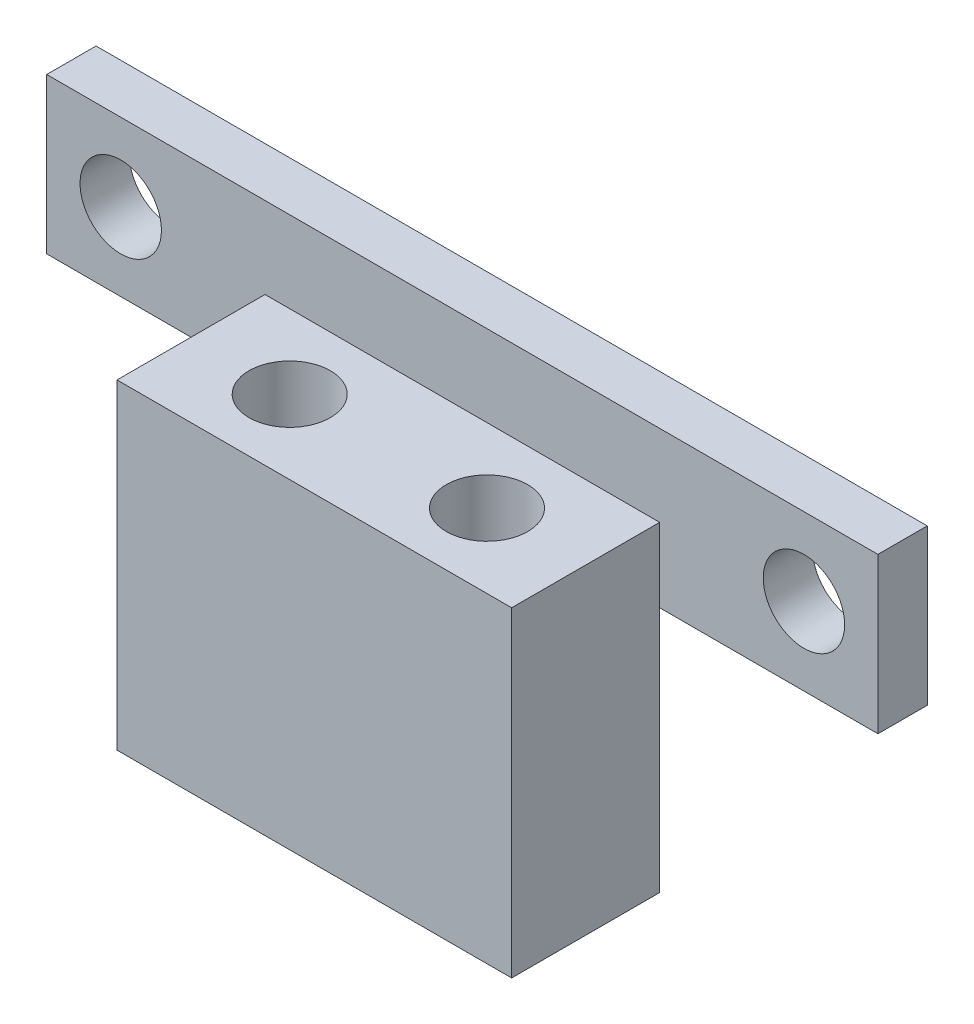
ISO-10303-21;
HEADER;
FILE_DESCRIPTION(('STEP AP214'),'2;1');
FILE_NAME('part.step','',(''),(''),'','','');
FILE_SCHEMA(('AUTOMOTIVE_DESIGN { 1 0 10303 214 1 1 1 1 }'));
ENDSEC;
DATA;
#1=APPLICATION_CONTEXT('core data for automotive mechanical design processes');
#2=APPLICATION_PROTOCOL_DEFINITION('international standard','automotive_design',2000,#1);
#3=PRODUCT_CONTEXT('',#1,'mechanical');
#4=PRODUCT('Part','Part','',(#3));
#5=PRODUCT_RELATED_PRODUCT_CATEGORY('part','',(#4));
#6=PRODUCT_DEFINITION_FORMATION('','',#4);
#7=PRODUCT_DEFINITION_CONTEXT('part definition',#1,'design');
#8=PRODUCT_DEFINITION('design','',#6,#7);
#9=PRODUCT_DEFINITION_SHAPE('','',#8);
#10=(LENGTH_UNIT() NAMED_UNIT(*) SI_UNIT(.MILLI.,.METRE.));
#11=(NAMED_UNIT(*) PLANE_ANGLE_UNIT() SI_UNIT($,.RADIAN.));
#12=(NAMED_UNIT(*) SI_UNIT($,.STERADIAN.) SOLID_ANGLE_UNIT());
#13=UNCERTAINTY_MEASURE_WITH_UNIT(LENGTH_MEASURE(1.E-05),#10,'distance_accuracy_value','');
#14=(GEOMETRIC_REPRESENTATION_CONTEXT(3) GLOBAL_UNCERTAINTY_ASSIGNED_CONTEXT((#13)) GLOBAL_UNIT_ASSIGNED_CONTEXT((#10,
#11,#12)) REPRESENTATION_CONTEXT('',''));
#15=CARTESIAN_POINT('',(0.,0.,0.));
#16=DIRECTION('',(0.,0.,1.));
#17=DIRECTION('',(1.,0.,0.));
#18=AXIS2_PLACEMENT_3D('',#15,#16,#17);
#19=CARTESIAN_POINT('',(0.,0.,2.));
#20=DIRECTION('',(0.,1.,0.));
#21=DIRECTION('',(0.,0.,1.));
#22=AXIS2_PLACEMENT_3D('',#19,#20,#21);
#23=PLANE('',#22);
#24=DIRECTION('',(1.,0.,0.));
#25=VECTOR('',#24,1.);
#26=CARTESIAN_POINT('',(8.85,0.,2.));
#27=LINE('',#26,#25);
#28=CARTESIAN_POINT('',(8.85,0.,2.));
#29=VERTEX_POINT('',#28);
#30=CARTESIAN_POINT('',(24.85,0.,2.));
#31=VERTEX_POINT('',#30);
#32=EDGE_CURVE('E64',#29,#31,#27,.T.);
#33=ORIENTED_EDGE('',*,*,#32,.F.);
#34=DIRECTION('',(1.,0.,0.));
#35=VECTOR('',#34,1.);
#36=CARTESIAN_POINT('',(0.,0.,2.));
#37=LINE('',#36,#35);
#38=CARTESIAN_POINT('',(0.,0.,2.));
#39=VERTEX_POINT('',#38);
#40=EDGE_CURVE('E181',#39,#29,#37,.T.);
#41=ORIENTED_EDGE('',*,*,#40,.F.);
#42=DIRECTION('',(0.,0.,-1.));
#43=VECTOR('',#42,1.);
#44=CARTESIAN_POINT('',(0.,0.,2.));
#45=LINE('',#44,#43);
#46=CARTESIAN_POINT('',(0.,0.,0.));
#47=VERTEX_POINT('',#46);
#48=EDGE_CURVE('E11',#39,#47,#45,.T.);
#49=ORIENTED_EDGE('',*,*,#48,.T.);
#50=DIRECTION('',(1.,0.,0.));
#51=VECTOR('',#50,1.);
#52=CARTESIAN_POINT('',(0.,0.,0.));
#53=LINE('',#52,#51);
#54=CARTESIAN_POINT('',(33.7,0.,0.));
#55=VERTEX_POINT('',#54);
#56=EDGE_CURVE('E190',#47,#55,#53,.T.);
#57=ORIENTED_EDGE('',*,*,#56,.T.);
#58=DIRECTION('',(0.,0.,-1.));
#59=VECTOR('',#58,1.);
#60=CARTESIAN_POINT('',(33.7,0.,2.));
#61=LINE('',#60,#59);
#62=CARTESIAN_POINT('',(33.7,0.,2.));
#63=VERTEX_POINT('',#62);
#64=EDGE_CURVE('E49',#63,#55,#61,.T.);
#65=ORIENTED_EDGE('',*,*,#64,.F.);
#66=EDGE_CURVE('E179',#31,#63,#37,.T.);
#67=ORIENTED_EDGE('',*,*,#66,.F.);
#68=EDGE_LOOP('',(#33,#41,#49,#57,#65,#67));
#69=FACE_BOUND('',#68,.T.);
#70=ADVANCED_FACE('F41',(#69),#23,.F.);
#71=CARTESIAN_POINT('',(0.,0.,2.));
#72=DIRECTION('',(0.,0.,-1.));
#73=DIRECTION('',(-1.,0.,0.));
#74=AXIS2_PLACEMENT_3D('',#71,#72,#73);
#75=PLANE('',#74);
#76=CARTESIAN_POINT('',(30.7,3.15,2.));
#77=DIRECTION('',(0.,0.,1.));
#78=DIRECTION('',(1.,0.,0.));
#79=AXIS2_PLACEMENT_3D('',#76,#77,#78);
#80=CIRCLE('',#79,1.65);
#81=CARTESIAN_POINT('',(32.35,3.15,2.));
#82=VERTEX_POINT('',#81);
#83=EDGE_CURVE('E164',#82,#82,#80,.T.);
#84=ORIENTED_EDGE('',*,*,#83,.F.);
#85=EDGE_LOOP('',(#84));
#86=FACE_BOUND('',#85,.T.);
#87=CARTESIAN_POINT('',(3.,3.15,2.));
#88=DIRECTION('',(0.,0.,1.));
#89=DIRECTION('',(1.,0.,0.));
#90=AXIS2_PLACEMENT_3D('',#87,#88,#89);
#91=CIRCLE('',#90,1.65);
#92=CARTESIAN_POINT('',(4.65,3.15,2.));
#93=VERTEX_POINT('',#92);
#94=EDGE_CURVE('E170',#93,#93,#91,.T.);
#95=ORIENTED_EDGE('',*,*,#94,.F.);
#96=EDGE_LOOP('',(#95));
#97=FACE_BOUND('',#96,.T.);
#98=DIRECTION('',(0.,-1.,0.));
#99=VECTOR('',#98,1.);
#100=CARTESIAN_POINT('',(8.85,0.,2.));
#101=LINE('',#100,#99);
#102=CARTESIAN_POINT('',(8.85,3.,2.));
#103=VERTEX_POINT('',#102);
#104=EDGE_CURVE('E56',#103,#29,#101,.T.);
#105=ORIENTED_EDGE('',*,*,#104,.F.);
#106=DIRECTION('',(-1.,0.,0.));
#107=VECTOR('',#106,1.);
#108=CARTESIAN_POINT('',(8.85,3.,2.));
#109=LINE('',#108,#107);
#110=CARTESIAN_POINT('',(24.85,3.,2.));
#111=VERTEX_POINT('',#110);
#112=EDGE_CURVE('E149',#111,#103,#109,.T.);
#113=ORIENTED_EDGE('',*,*,#112,.F.);
#114=DIRECTION('',(0.,1.,0.));
#115=VECTOR('',#114,1.);
#116=CARTESIAN_POINT('',(24.85,0.,2.));
#117=LINE('',#116,#115);
#118=EDGE_CURVE('E155',#31,#111,#117,.T.);
#119=ORIENTED_EDGE('',*,*,#118,.F.);
#120=ORIENTED_EDGE('',*,*,#66,.T.);
#121=DIRECTION('',(0.,1.,0.));
#122=VECTOR('',#121,1.);
#123=CARTESIAN_POINT('',(33.7,0.,2.));
#124=LINE('',#123,#122);
#125=CARTESIAN_POINT('',(33.7,6.3,2.));
#126=VERTEX_POINT('',#125);
#127=EDGE_CURVE('E183',#63,#126,#124,.T.);
#128=ORIENTED_EDGE('',*,*,#127,.T.);
#129=DIRECTION('',(-1.,0.,0.));
#130=VECTOR('',#129,1.);
#131=CARTESIAN_POINT('',(0.,6.3,2.));
#132=LINE('',#131,#130);
#133=CARTESIAN_POINT('',(0.,6.3,2.));
#134=VERTEX_POINT('',#133);
#135=EDGE_CURVE('E185',#126,#134,#132,.T.);
#136=ORIENTED_EDGE('',*,*,#135,.T.);
#137=DIRECTION('',(0.,-1.,0.));
#138=VECTOR('',#137,1.);
#139=CARTESIAN_POINT('',(0.,0.,2.));
#140=LINE('',#139,#138);
#141=EDGE_CURVE('E176',#134,#39,#140,.T.);
#142=ORIENTED_EDGE('',*,*,#141,.T.);
#143=ORIENTED_EDGE('',*,*,#40,.T.);
#144=EDGE_LOOP('',(#105,#113,#119,#120,#128,#136,#142,#143));
#145=FACE_BOUND('',#144,.T.);
#146=ADVANCED_FACE('F218',(#86,#97,#145),#75,.F.);
#147=CARTESIAN_POINT('',(0.,0.,0.));
#148=DIRECTION('',(0.,0.,-1.));
#149=DIRECTION('',(-1.,0.,0.));
#150=AXIS2_PLACEMENT_3D('',#147,#148,#149);
#151=PLANE('',#150);
#152=CARTESIAN_POINT('',(3.,3.15,0.));
#153=DIRECTION('',(0.,0.,1.));
#154=DIRECTION('',(1.,0.,0.));
#155=AXIS2_PLACEMENT_3D('',#152,#153,#154);
#156=CIRCLE('',#155,1.65);
#157=CARTESIAN_POINT('',(4.65,3.15,0.));
#158=VERTEX_POINT('',#157);
#159=EDGE_CURVE('E167',#158,#158,#156,.T.);
#160=ORIENTED_EDGE('',*,*,#159,.T.);
#161=EDGE_LOOP('',(#160));
#162=FACE_BOUND('',#161,.T.);
#163=DIRECTION('',(0.,-1.,0.));
#164=VECTOR('',#163,1.);
#165=CARTESIAN_POINT('',(0.,0.,0.));
#166=LINE('',#165,#164);
#167=CARTESIAN_POINT('',(0.,6.3,0.));
#168=VERTEX_POINT('',#167);
#169=EDGE_CURVE('E173',#168,#47,#166,.T.);
#170=ORIENTED_EDGE('',*,*,#169,.F.);
#171=DIRECTION('',(-1.,0.,0.));
#172=VECTOR('',#171,1.);
#173=CARTESIAN_POINT('',(0.,6.3,0.));
#174=LINE('',#173,#172);
#175=CARTESIAN_POINT('',(33.7,6.3,0.));
#176=VERTEX_POINT('',#175);
#177=EDGE_CURVE('E180',#176,#168,#174,.T.);
#178=ORIENTED_EDGE('',*,*,#177,.F.);
#179=DIRECTION('',(0.,1.,0.));
#180=VECTOR('',#179,1.);
#181=CARTESIAN_POINT('',(33.7,0.,0.));
#182=LINE('',#181,#180);
#183=EDGE_CURVE('E192',#55,#176,#182,.T.);
#184=ORIENTED_EDGE('',*,*,#183,.F.);
#185=ORIENTED_EDGE('',*,*,#56,.F.);
#186=EDGE_LOOP('',(#170,#178,#184,#185));
#187=FACE_BOUND('',#186,.T.);
#188=CARTESIAN_POINT('',(30.7,3.15,0.));
#189=DIRECTION('',(0.,0.,1.));
#190=DIRECTION('',(1.,0.,0.));
#191=AXIS2_PLACEMENT_3D('',#188,#189,#190);
#192=CIRCLE('',#191,1.65);
#193=CARTESIAN_POINT('',(32.35,3.15,0.));
#194=VERTEX_POINT('',#193);
#195=EDGE_CURVE('E163',#194,#194,#192,.T.);
#196=ORIENTED_EDGE('',*,*,#195,.T.);
#197=EDGE_LOOP('',(#196));
#198=FACE_BOUND('',#197,.T.);
#199=ADVANCED_FACE('F209',(#162,#187,#198),#151,.T.);
#200=CARTESIAN_POINT('',(0.,0.,2.));
#201=DIRECTION('',(1.,0.,0.));
#202=DIRECTION('',(0.,0.,-1.));
#203=AXIS2_PLACEMENT_3D('',#200,#201,#202);
#204=PLANE('',#203);
#205=ORIENTED_EDGE('',*,*,#169,.T.);
#206=ORIENTED_EDGE('',*,*,#48,.F.);
#207=ORIENTED_EDGE('',*,*,#141,.F.);
#208=DIRECTION('',(0.,0.,-1.));
#209=VECTOR('',#208,1.);
#210=CARTESIAN_POINT('',(0.,6.3,2.));
#211=LINE('',#210,#209);
#212=EDGE_CURVE('E187',#134,#168,#211,.T.);
#213=ORIENTED_EDGE('',*,*,#212,.T.);
#214=EDGE_LOOP('',(#205,#206,#207,#213));
#215=FACE_BOUND('',#214,.T.);
#216=ADVANCED_FACE('F43',(#215),#204,.F.);
#217=CARTESIAN_POINT('',(33.7,0.,2.));
#218=DIRECTION('',(-1.,0.,0.));
#219=DIRECTION('',(0.,0.,1.));
#220=AXIS2_PLACEMENT_3D('',#217,#218,#219);
#221=PLANE('',#220);
#222=ORIENTED_EDGE('',*,*,#183,.T.);
#223=DIRECTION('',(0.,0.,-1.));
#224=VECTOR('',#223,1.);
#225=CARTESIAN_POINT('',(33.7,6.3,2.));
#226=LINE('',#225,#224);
#227=EDGE_CURVE('E197',#126,#176,#226,.T.);
#228=ORIENTED_EDGE('',*,*,#227,.F.);
#229=ORIENTED_EDGE('',*,*,#127,.F.);
#230=ORIENTED_EDGE('',*,*,#64,.T.);
#231=EDGE_LOOP('',(#222,#228,#229,#230));
#232=FACE_BOUND('',#231,.T.);
#233=ADVANCED_FACE('F204',(#232),#221,.F.);
#234=CARTESIAN_POINT('',(0.,6.3,2.));
#235=DIRECTION('',(0.,-1.,0.));
#236=DIRECTION('',(0.,0.,-1.));
#237=AXIS2_PLACEMENT_3D('',#234,#235,#236);
#238=PLANE('',#237);
#239=ORIENTED_EDGE('',*,*,#177,.T.);
#240=ORIENTED_EDGE('',*,*,#212,.F.);
#241=ORIENTED_EDGE('',*,*,#135,.F.);
#242=ORIENTED_EDGE('',*,*,#227,.T.);
#243=EDGE_LOOP('',(#239,#240,#241,#242));
#244=FACE_BOUND('',#243,.T.);
#245=ADVANCED_FACE('F213',(#244),#238,.F.);
#246=CARTESIAN_POINT('',(3.,3.15,2.));
#247=DIRECTION('',(0.,0.,-1.));
#248=DIRECTION('',(-1.,0.,0.));
#249=AXIS2_PLACEMENT_3D('',#246,#247,#248);
#250=CYLINDRICAL_SURFACE('',#249,1.65);
#251=ORIENTED_EDGE('',*,*,#94,.T.);
#252=EDGE_LOOP('',(#251));
#253=FACE_BOUND('',#252,.T.);
#254=ORIENTED_EDGE('',*,*,#159,.F.);
#255=EDGE_LOOP('',(#254));
#256=FACE_BOUND('',#255,.T.);
#257=ADVANCED_FACE('F232',(#253,#256),#250,.F.);
#258=CARTESIAN_POINT('',(30.7,3.15,2.));
#259=DIRECTION('',(0.,0.,-1.));
#260=DIRECTION('',(-1.,0.,0.));
#261=AXIS2_PLACEMENT_3D('',#258,#259,#260);
#262=CYLINDRICAL_SURFACE('',#261,1.65);
#263=ORIENTED_EDGE('',*,*,#83,.T.);
#264=EDGE_LOOP('',(#263));
#265=FACE_BOUND('',#264,.T.);
#266=ORIENTED_EDGE('',*,*,#195,.F.);
#267=EDGE_LOOP('',(#266));
#268=FACE_BOUND('',#267,.T.);
#269=ADVANCED_FACE('F238',(#265,#268),#262,.F.);
#270=CARTESIAN_POINT('',(8.85,0.,8.));
#271=DIRECTION('',(1.,0.,0.));
#272=DIRECTION('',(0.,0.,-1.));
#273=AXIS2_PLACEMENT_3D('',#270,#271,#272);
#274=PLANE('',#273);
#275=ORIENTED_EDGE('',*,*,#104,.T.);
#276=DIRECTION('',(0.,1.,0.));
#277=VECTOR('',#276,1.);
#278=CARTESIAN_POINT('',(8.85,-10.,2.));
#279=LINE('',#278,#277);
#280=CARTESIAN_POINT('',(8.85,-10.,2.));
#281=VERTEX_POINT('',#280);
#282=EDGE_CURVE('E116',#281,#29,#279,.T.);
#283=ORIENTED_EDGE('',*,*,#282,.F.);
#284=DIRECTION('',(0.,0.,-1.));
#285=VECTOR('',#284,1.);
#286=CARTESIAN_POINT('',(8.85,-10.,8.));
#287=LINE('',#286,#285);
#288=CARTESIAN_POINT('',(8.85,-10.,8.));
#289=VERTEX_POINT('',#288);
#290=EDGE_CURVE('E123',#289,#281,#287,.T.);
#291=ORIENTED_EDGE('',*,*,#290,.F.);
#292=DIRECTION('',(0.,-1.,0.));
#293=VECTOR('',#292,1.);
#294=CARTESIAN_POINT('',(8.85,0.,8.));
#295=LINE('',#294,#293);
#296=CARTESIAN_POINT('',(8.85,3.,8.));
#297=VERTEX_POINT('',#296);
#298=EDGE_CURVE('E146',#297,#289,#295,.T.);
#299=ORIENTED_EDGE('',*,*,#298,.F.);
#300=DIRECTION('',(0.,0.,-1.));
#301=VECTOR('',#300,1.);
#302=CARTESIAN_POINT('',(8.85,3.,8.));
#303=LINE('',#302,#301);
#304=EDGE_CURVE('E153',#297,#103,#303,.T.);
#305=ORIENTED_EDGE('',*,*,#304,.T.);
#306=EDGE_LOOP('',(#275,#283,#291,#299,#305));
#307=FACE_BOUND('',#306,.T.);
#308=ADVANCED_FACE('F134',(#307),#274,.F.);
#309=CARTESIAN_POINT('',(24.85,0.,8.));
#310=DIRECTION('',(-1.,0.,0.));
#311=DIRECTION('',(0.,0.,1.));
#312=AXIS2_PLACEMENT_3D('',#309,#310,#311);
#313=PLANE('',#312);
#314=ORIENTED_EDGE('',*,*,#118,.T.);
#315=DIRECTION('',(0.,0.,-1.));
#316=VECTOR('',#315,1.);
#317=CARTESIAN_POINT('',(24.85,3.,8.));
#318=LINE('',#317,#316);
#319=CARTESIAN_POINT('',(24.85,3.,8.));
#320=VERTEX_POINT('',#319);
#321=EDGE_CURVE('E160',#320,#111,#318,.T.);
#322=ORIENTED_EDGE('',*,*,#321,.F.);
#323=DIRECTION('',(0.,1.,0.));
#324=VECTOR('',#323,1.);
#325=CARTESIAN_POINT('',(24.85,0.,8.));
#326=LINE('',#325,#324);
#327=CARTESIAN_POINT('',(24.85,-10.,8.));
#328=VERTEX_POINT('',#327);
#329=EDGE_CURVE('E148',#328,#320,#326,.T.);
#330=ORIENTED_EDGE('',*,*,#329,.F.);
#331=DIRECTION('',(0.,0.,1.));
#332=VECTOR('',#331,1.);
#333=CARTESIAN_POINT('',(24.85,-10.,8.));
#334=LINE('',#333,#332);
#335=CARTESIAN_POINT('',(24.85,-10.,2.));
#336=VERTEX_POINT('',#335);
#337=EDGE_CURVE('E122',#336,#328,#334,.T.);
#338=ORIENTED_EDGE('',*,*,#337,.F.);
#339=DIRECTION('',(0.,1.,0.));
#340=VECTOR('',#339,1.);
#341=CARTESIAN_POINT('',(24.85,-10.,2.));
#342=LINE('',#341,#340);
#343=EDGE_CURVE('E118',#336,#31,#342,.T.);
#344=ORIENTED_EDGE('',*,*,#343,.T.);
#345=EDGE_LOOP('',(#314,#322,#330,#338,#344));
#346=FACE_BOUND('',#345,.T.);
#347=ADVANCED_FACE('F245',(#346),#313,.F.);
#348=CARTESIAN_POINT('',(8.85,3.,8.));
#349=DIRECTION('',(0.,-1.,0.));
#350=DIRECTION('',(0.,0.,-1.));
#351=AXIS2_PLACEMENT_3D('',#348,#349,#350);
#352=PLANE('',#351);
#353=CARTESIAN_POINT('',(12.85,3.,5.));
#354=DIRECTION('',(0.,1.,0.));
#355=DIRECTION('',(0.,0.,1.));
#356=AXIS2_PLACEMENT_3D('',#353,#354,#355);
#357=CIRCLE('',#356,1.65);
#358=CARTESIAN_POINT('',(12.85,3.,6.65));
#359=VERTEX_POINT('',#358);
#360=EDGE_CURVE('E139',#359,#359,#357,.T.);
#361=ORIENTED_EDGE('',*,*,#360,.F.);
#362=EDGE_LOOP('',(#361));
#363=FACE_BOUND('',#362,.T.);
#364=CARTESIAN_POINT('',(20.85,3.,5.));
#365=DIRECTION('',(0.,1.,0.));
#366=DIRECTION('',(0.,0.,1.));
#367=AXIS2_PLACEMENT_3D('',#364,#365,#366);
#368=CIRCLE('',#367,1.65);
#369=CARTESIAN_POINT('',(20.85,3.,6.65));
#370=VERTEX_POINT('',#369);
#371=EDGE_CURVE('E136',#370,#370,#368,.T.);
#372=ORIENTED_EDGE('',*,*,#371,.F.);
#373=EDGE_LOOP('',(#372));
#374=FACE_BOUND('',#373,.T.);
#375=ORIENTED_EDGE('',*,*,#112,.T.);
#376=ORIENTED_EDGE('',*,*,#304,.F.);
#377=DIRECTION('',(-1.,0.,0.));
#378=VECTOR('',#377,1.);
#379=CARTESIAN_POINT('',(8.85,3.,8.));
#380=LINE('',#379,#378);
#381=EDGE_CURVE('E151',#320,#297,#380,.T.);
#382=ORIENTED_EDGE('',*,*,#381,.F.);
#383=ORIENTED_EDGE('',*,*,#321,.T.);
#384=EDGE_LOOP('',(#375,#376,#382,#383));
#385=FACE_BOUND('',#384,.T.);
#386=ADVANCED_FACE('F248',(#363,#374,#385),#352,.F.);
#387=CARTESIAN_POINT('',(0.,0.,8.));
#388=DIRECTION('',(0.,0.,-1.));
#389=DIRECTION('',(-1.,0.,0.));
#390=AXIS2_PLACEMENT_3D('',#387,#388,#389);
#391=PLANE('',#390);
#392=ORIENTED_EDGE('',*,*,#298,.T.);
#393=DIRECTION('',(-1.,0.,0.));
#394=VECTOR('',#393,1.);
#395=CARTESIAN_POINT('',(8.85,-10.,8.));
#396=LINE('',#395,#394);
#397=EDGE_CURVE('E130',#328,#289,#396,.T.);
#398=ORIENTED_EDGE('',*,*,#397,.F.);
#399=ORIENTED_EDGE('',*,*,#329,.T.);
#400=ORIENTED_EDGE('',*,*,#381,.T.);
#401=EDGE_LOOP('',(#392,#398,#399,#400));
#402=FACE_BOUND('',#401,.T.);
#403=ADVANCED_FACE('F251',(#402),#391,.F.);
#404=CARTESIAN_POINT('',(20.85,-3.,5.));
#405=DIRECTION('',(0.,1.,0.));
#406=DIRECTION('',(0.,0.,1.));
#407=AXIS2_PLACEMENT_3D('',#404,#405,#406);
#408=CYLINDRICAL_SURFACE('',#407,1.65);
#409=ORIENTED_EDGE('',*,*,#371,.T.);
#410=EDGE_LOOP('',(#409));
#411=FACE_BOUND('',#410,.T.);
#412=CARTESIAN_POINT('',(20.85,-10.,5.));
#413=DIRECTION('',(0.,-1.,0.));
#414=DIRECTION('',(0.,0.,-1.));
#415=AXIS2_PLACEMENT_3D('',#412,#413,#414);
#416=CIRCLE('',#415,1.65);
#417=CARTESIAN_POINT('',(20.85,-10.,3.35));
#418=VERTEX_POINT('',#417);
#419=EDGE_CURVE('E274',#418,#418,#416,.T.);
#420=ORIENTED_EDGE('',*,*,#419,.T.);
#421=EDGE_LOOP('',(#420));
#422=FACE_BOUND('',#421,.T.);
#423=ADVANCED_FACE('F255',(#411,#422),#408,.F.);
#424=CARTESIAN_POINT('',(12.85,-3.,5.));
#425=DIRECTION('',(0.,1.,0.));
#426=DIRECTION('',(0.,0.,1.));
#427=AXIS2_PLACEMENT_3D('',#424,#425,#426);
#428=CYLINDRICAL_SURFACE('',#427,1.65);
#429=ORIENTED_EDGE('',*,*,#360,.T.);
#430=EDGE_LOOP('',(#429));
#431=FACE_BOUND('',#430,.T.);
#432=CARTESIAN_POINT('',(12.85,-10.,5.));
#433=DIRECTION('',(0.,-1.,0.));
#434=DIRECTION('',(0.,0.,-1.));
#435=AXIS2_PLACEMENT_3D('',#432,#433,#434);
#436=CIRCLE('',#435,1.65);
#437=CARTESIAN_POINT('',(12.85,-10.,3.35));
#438=VERTEX_POINT('',#437);
#439=EDGE_CURVE('E272',#438,#438,#436,.T.);
#440=ORIENTED_EDGE('',*,*,#439,.T.);
#441=EDGE_LOOP('',(#440));
#442=FACE_BOUND('',#441,.T.);
#443=ADVANCED_FACE('F259',(#431,#442),#428,.F.);
#444=CARTESIAN_POINT('',(0.,-10.,0.));
#445=DIRECTION('',(0.,-1.,0.));
#446=DIRECTION('',(0.,0.,-1.));
#447=AXIS2_PLACEMENT_3D('',#444,#445,#446);
#448=PLANE('',#447);
#449=ORIENTED_EDGE('',*,*,#439,.F.);
#450=EDGE_LOOP('',(#449));
#451=FACE_BOUND('',#450,.T.);
#452=ORIENTED_EDGE('',*,*,#290,.T.);
#453=DIRECTION('',(1.,0.,0.));
#454=VECTOR('',#453,1.);
#455=CARTESIAN_POINT('',(8.85,-10.,2.));
#456=LINE('',#455,#454);
#457=EDGE_CURVE('E112',#281,#336,#456,.T.);
#458=ORIENTED_EDGE('',*,*,#457,.T.);
#459=ORIENTED_EDGE('',*,*,#337,.T.);
#460=ORIENTED_EDGE('',*,*,#397,.T.);
#461=EDGE_LOOP('',(#452,#458,#459,#460));
#462=FACE_BOUND('',#461,.T.);
#463=ORIENTED_EDGE('',*,*,#419,.F.);
#464=EDGE_LOOP('',(#463));
#465=FACE_BOUND('',#464,.T.);
#466=ADVANCED_FACE('F127',(#451,#462,#465),#448,.T.);
#467=CARTESIAN_POINT('',(8.85,-10.,2.));
#468=DIRECTION('',(0.,0.,1.));
#469=DIRECTION('',(1.,0.,0.));
#470=AXIS2_PLACEMENT_3D('',#467,#468,#469);
#471=PLANE('',#470);
#472=ORIENTED_EDGE('',*,*,#32,.T.);
#473=ORIENTED_EDGE('',*,*,#343,.F.);
#474=ORIENTED_EDGE('',*,*,#457,.F.);
#475=ORIENTED_EDGE('',*,*,#282,.T.);
#476=EDGE_LOOP('',(#472,#473,#474,#475));
#477=FACE_BOUND('',#476,.T.);
#478=ADVANCED_FACE('F114',(#477),#471,.F.);
#479=CLOSED_SHELL('',(#70,#146,#199,#216,#233,#245,#257,#269,#308,#347,#386,#403,#423,#443,#466,#478));
#480=MANIFOLD_SOLID_BREP('B2',#479);
#481=ADVANCED_BREP_SHAPE_REPRESENTATION('',(#18,#480),#14);
#482=SHAPE_DEFINITION_REPRESENTATION(#9,#481);
ENDSEC;
END-ISO-10303-21;
